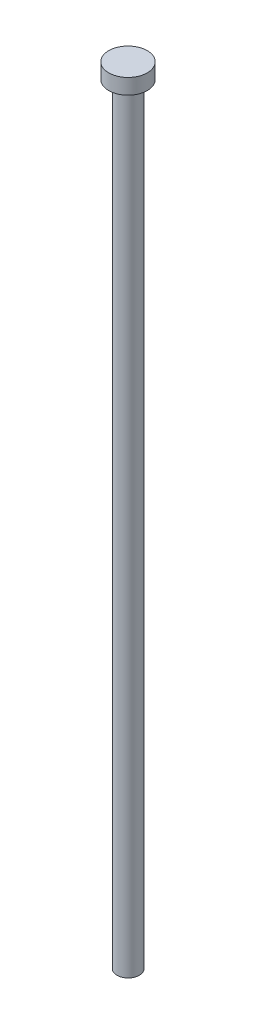
ISO-10303-21;
HEADER;
FILE_DESCRIPTION(('STEP AP214'),'2;1');
FILE_NAME('part.step','',(''),(''),'','','');
FILE_SCHEMA(('AUTOMOTIVE_DESIGN { 1 0 10303 214 1 1 1 1 }'));
ENDSEC;
DATA;
#1=APPLICATION_CONTEXT('core data for automotive mechanical design processes');
#2=APPLICATION_PROTOCOL_DEFINITION('international standard','automotive_design',2000,#1);
#3=PRODUCT_CONTEXT('',#1,'mechanical');
#4=PRODUCT('Part','Part','',(#3));
#5=PRODUCT_RELATED_PRODUCT_CATEGORY('part','',(#4));
#6=PRODUCT_DEFINITION_FORMATION('','',#4);
#7=PRODUCT_DEFINITION_CONTEXT('part definition',#1,'design');
#8=PRODUCT_DEFINITION('design','',#6,#7);
#9=PRODUCT_DEFINITION_SHAPE('','',#8);
#10=(LENGTH_UNIT() NAMED_UNIT(*) SI_UNIT(.MILLI.,.METRE.));
#11=(NAMED_UNIT(*) PLANE_ANGLE_UNIT() SI_UNIT($,.RADIAN.));
#12=(NAMED_UNIT(*) SI_UNIT($,.STERADIAN.) SOLID_ANGLE_UNIT());
#13=UNCERTAINTY_MEASURE_WITH_UNIT(LENGTH_MEASURE(1.E-05),#10,'distance_accuracy_value','');
#14=(GEOMETRIC_REPRESENTATION_CONTEXT(3) GLOBAL_UNCERTAINTY_ASSIGNED_CONTEXT((#13)) GLOBAL_UNIT_ASSIGNED_CONTEXT((#10,
#11,#12)) REPRESENTATION_CONTEXT('',''));
#15=CARTESIAN_POINT('',(0.,0.,0.));
#16=DIRECTION('',(0.,0.,1.));
#17=DIRECTION('',(1.,0.,0.));
#18=AXIS2_PLACEMENT_3D('',#15,#16,#17);
#19=CARTESIAN_POINT('',(-0.0216984538518685,100.,-0.0462661247420035));
#20=DIRECTION('',(0.,-1.,0.));
#21=DIRECTION('',(0.,0.,-1.));
#22=AXIS2_PLACEMENT_3D('',#19,#20,#21);
#23=CYLINDRICAL_SURFACE('',#22,1.45);
#24=CARTESIAN_POINT('',(-0.0216984538518685,100.,-0.0462661247420035));
#25=DIRECTION('',(0.,1.,0.));
#26=DIRECTION('',(0.,0.,1.));
#27=AXIS2_PLACEMENT_3D('',#24,#25,#26);
#28=CIRCLE('',#27,1.45);
#29=CARTESIAN_POINT('',(-0.0216984538518685,100.,1.403733875258));
#30=VERTEX_POINT('',#29);
#31=EDGE_CURVE('E10',#30,#30,#28,.T.);
#32=ORIENTED_EDGE('',*,*,#31,.F.);
#33=EDGE_LOOP('',(#32));
#34=FACE_BOUND('',#33,.T.);
#35=CARTESIAN_POINT('',(-0.0216984538518685,0.,-0.0462661247420035));
#36=DIRECTION('',(0.,1.,0.));
#37=DIRECTION('',(0.,0.,1.));
#38=AXIS2_PLACEMENT_3D('',#35,#36,#37);
#39=CIRCLE('',#38,1.45);
#40=CARTESIAN_POINT('',(-0.0216984538518685,0.,1.403733875258));
#41=VERTEX_POINT('',#40);
#42=EDGE_CURVE('E36',#41,#41,#39,.T.);
#43=ORIENTED_EDGE('',*,*,#42,.T.);
#44=EDGE_LOOP('',(#43));
#45=FACE_BOUND('',#44,.T.);
#46=ADVANCED_FACE('F33',(#34,#45),#23,.T.);
#47=CARTESIAN_POINT('',(-0.0216984538518685,0.,-0.0462661247420035));
#48=DIRECTION('',(0.,1.,0.));
#49=DIRECTION('',(0.,0.,1.));
#50=AXIS2_PLACEMENT_3D('',#47,#48,#49);
#51=PLANE('',#50);
#52=ORIENTED_EDGE('',*,*,#42,.F.);
#53=EDGE_LOOP('',(#52));
#54=FACE_BOUND('',#53,.T.);
#55=ADVANCED_FACE('F56',(#54),#51,.F.);
#56=CARTESIAN_POINT('',(0.0107297479612356,102.,0.00630272913215713));
#57=DIRECTION('',(0.,-1.,0.));
#58=DIRECTION('',(0.,0.,-1.));
#59=AXIS2_PLACEMENT_3D('',#56,#57,#58);
#60=CYLINDRICAL_SURFACE('',#59,2.5);
#61=CARTESIAN_POINT('',(0.0107297479612356,102.,0.00630272913215713));
#62=DIRECTION('',(0.,1.,0.));
#63=DIRECTION('',(0.,0.,1.));
#64=AXIS2_PLACEMENT_3D('',#61,#62,#63);
#65=CIRCLE('',#64,2.5);
#66=CARTESIAN_POINT('',(0.0107297479612356,102.,2.50630272913216));
#67=VERTEX_POINT('',#66);
#68=EDGE_CURVE('E43',#67,#67,#65,.T.);
#69=ORIENTED_EDGE('',*,*,#68,.F.);
#70=EDGE_LOOP('',(#69));
#71=FACE_BOUND('',#70,.T.);
#72=CARTESIAN_POINT('',(0.0107297479612356,100.,0.00630272913215713));
#73=DIRECTION('',(0.,1.,0.));
#74=DIRECTION('',(0.,0.,1.));
#75=AXIS2_PLACEMENT_3D('',#72,#73,#74);
#76=CIRCLE('',#75,2.5);
#77=CARTESIAN_POINT('',(0.0107297479612356,100.,2.50630272913216));
#78=VERTEX_POINT('',#77);
#79=EDGE_CURVE('E45',#78,#78,#76,.T.);
#80=ORIENTED_EDGE('',*,*,#79,.T.);
#81=EDGE_LOOP('',(#80));
#82=FACE_BOUND('',#81,.T.);
#83=ADVANCED_FACE('F53',(#71,#82),#60,.T.);
#84=CARTESIAN_POINT('',(0.0107297479612356,102.,0.00630272913215713));
#85=DIRECTION('',(0.,1.,0.));
#86=DIRECTION('',(0.,0.,1.));
#87=AXIS2_PLACEMENT_3D('',#84,#85,#86);
#88=PLANE('',#87);
#89=ORIENTED_EDGE('',*,*,#68,.T.);
#90=EDGE_LOOP('',(#89));
#91=FACE_BOUND('',#90,.T.);
#92=ADVANCED_FACE('F51',(#91),#88,.T.);
#93=CARTESIAN_POINT('',(0.0107297479612356,100.,0.00630272913215713));
#94=DIRECTION('',(0.,1.,0.));
#95=DIRECTION('',(0.,0.,1.));
#96=AXIS2_PLACEMENT_3D('',#93,#94,#95);
#97=PLANE('',#96);
#98=ORIENTED_EDGE('',*,*,#31,.T.);
#99=EDGE_LOOP('',(#98));
#100=FACE_BOUND('',#99,.T.);
#101=ORIENTED_EDGE('',*,*,#79,.F.);
#102=EDGE_LOOP('',(#101));
#103=FACE_BOUND('',#102,.T.);
#104=ADVANCED_FACE('F60',(#100,#103),#97,.F.);
#105=CLOSED_SHELL('',(#46,#55,#83,#92,#104));
#106=MANIFOLD_SOLID_BREP('B2',#105);
#107=ADVANCED_BREP_SHAPE_REPRESENTATION('',(#18,#106),#14);
#108=SHAPE_DEFINITION_REPRESENTATION(#9,#107);
ENDSEC;
END-ISO-10303-21;
